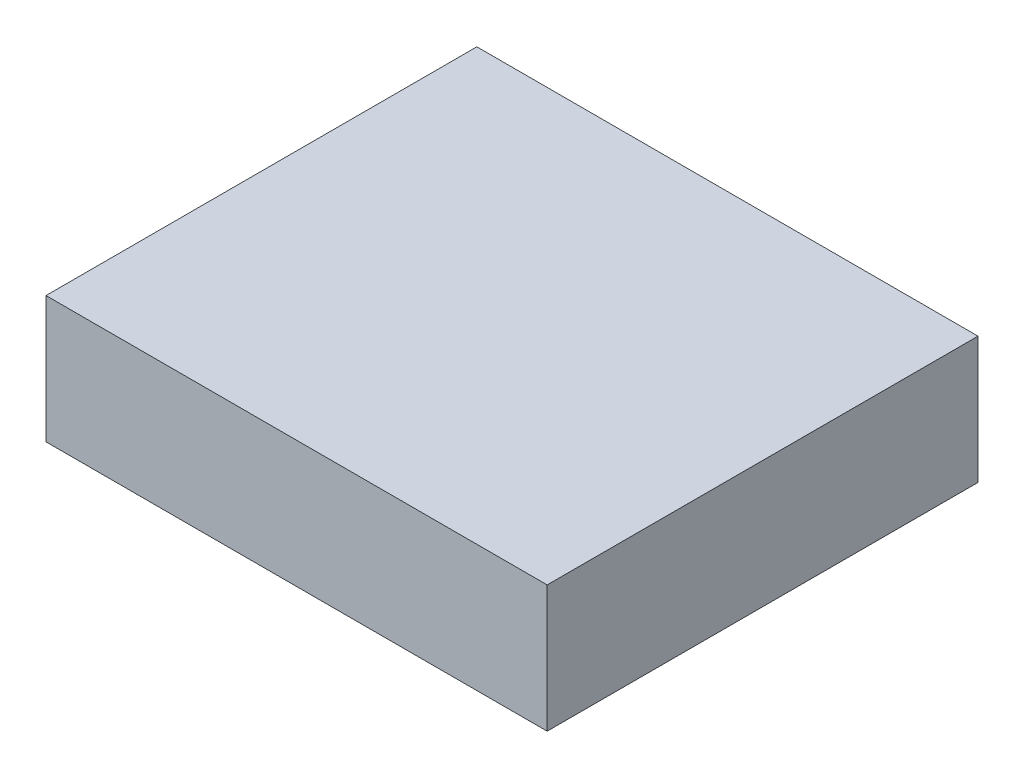
ISO-10303-21;
HEADER;
FILE_DESCRIPTION(('STEP AP214'),'2;1');
FILE_NAME('part.step','',(''),(''),'','','');
FILE_SCHEMA(('AUTOMOTIVE_DESIGN { 1 0 10303 214 1 1 1 1 }'));
ENDSEC;
DATA;
#1=APPLICATION_CONTEXT('core data for automotive mechanical design processes');
#2=APPLICATION_PROTOCOL_DEFINITION('international standard','automotive_design',2000,#1);
#3=PRODUCT_CONTEXT('',#1,'mechanical');
#4=PRODUCT('Part','Part','',(#3));
#5=PRODUCT_RELATED_PRODUCT_CATEGORY('part','',(#4));
#6=PRODUCT_DEFINITION_FORMATION('','',#4);
#7=PRODUCT_DEFINITION_CONTEXT('part definition',#1,'design');
#8=PRODUCT_DEFINITION('design','',#6,#7);
#9=PRODUCT_DEFINITION_SHAPE('','',#8);
#10=(LENGTH_UNIT() NAMED_UNIT(*) SI_UNIT(.MILLI.,.METRE.));
#11=(NAMED_UNIT(*) PLANE_ANGLE_UNIT() SI_UNIT($,.RADIAN.));
#12=(NAMED_UNIT(*) SI_UNIT($,.STERADIAN.) SOLID_ANGLE_UNIT());
#13=UNCERTAINTY_MEASURE_WITH_UNIT(LENGTH_MEASURE(1.E-05),#10,'distance_accuracy_value','');
#14=(GEOMETRIC_REPRESENTATION_CONTEXT(3) GLOBAL_UNCERTAINTY_ASSIGNED_CONTEXT((#13)) GLOBAL_UNIT_ASSIGNED_CONTEXT((#10,
#11,#12)) REPRESENTATION_CONTEXT('',''));
#15=CARTESIAN_POINT('',(0.,0.,0.));
#16=DIRECTION('',(0.,0.,1.));
#17=DIRECTION('',(1.,0.,0.));
#18=AXIS2_PLACEMENT_3D('',#15,#16,#17);
#19=CARTESIAN_POINT('',(0.,3.,0.));
#20=DIRECTION('',(0.,-1.,0.));
#21=DIRECTION('',(0.,0.,-1.));
#22=AXIS2_PLACEMENT_3D('',#19,#20,#21);
#23=PLANE('',#22);
#24=CARTESIAN_POINT('',(15.,3.,24.));
#25=DIRECTION('',(0.,1.,0.));
#26=DIRECTION('',(0.,0.,1.));
#27=AXIS2_PLACEMENT_3D('',#24,#25,#26);
#28=CIRCLE('',#27,10.5);
#29=CARTESIAN_POINT('',(15.,3.,34.5));
#30=VERTEX_POINT('',#29);
#31=EDGE_CURVE('E142',#30,#30,#28,.T.);
#32=ORIENTED_EDGE('',*,*,#31,.T.);
#33=EDGE_LOOP('',(#32));
#34=FACE_BOUND('',#33,.T.);
#35=DIRECTION('',(0.,0.,-1.));
#36=VECTOR('',#35,1.);
#37=CARTESIAN_POINT('',(-9.84277666215087,3.,40.));
#38=LINE('',#37,#36);
#39=CARTESIAN_POINT('',(-9.84277666215087,3.,39.8427766621509));
#40=VERTEX_POINT('',#39);
#41=CARTESIAN_POINT('',(-9.84277666215087,3.,48.8612539029861));
#42=VERTEX_POINT('',#41);
#43=EDGE_CURVE('E113',#40,#42,#38,.F.);
#44=ORIENTED_EDGE('',*,*,#43,.F.);
#45=DIRECTION('',(-1.,0.,0.));
#46=VECTOR('',#45,1.);
#47=CARTESIAN_POINT('',(-30.,3.,39.8427766621509));
#48=LINE('',#47,#46);
#49=CARTESIAN_POINT('',(-29.9475463643187,3.,39.8427766621509));
#50=VERTEX_POINT('',#49);
#51=EDGE_CURVE('E106',#50,#40,#48,.F.);
#52=ORIENTED_EDGE('',*,*,#51,.F.);
#53=CARTESIAN_POINT('',(0.,3.,0.));
#54=DIRECTION('',(0.,1.,0.));
#55=DIRECTION('',(0.,0.,1.));
#56=AXIS2_PLACEMENT_3D('',#53,#54,#55);
#57=CIRCLE('',#56,49.8427766621509);
#58=CARTESIAN_POINT('',(-42.8427766621509,3.,25.4715306424666));
#59=VERTEX_POINT('',#58);
#60=EDGE_CURVE('E110',#59,#50,#57,.T.);
#61=ORIENTED_EDGE('',*,*,#60,.F.);
#62=DIRECTION('',(0.,0.,-1.));
#63=VECTOR('',#62,1.);
#64=CARTESIAN_POINT('',(-42.8427766621509,3.,-25.5147016443462));
#65=LINE('',#64,#63);
#66=CARTESIAN_POINT('',(-42.8427766621509,3.,-25.4715306424666));
#67=VERTEX_POINT('',#66);
#68=EDGE_CURVE('E126',#67,#59,#65,.F.);
#69=ORIENTED_EDGE('',*,*,#68,.F.);
#70=CARTESIAN_POINT('',(0.,3.,0.));
#71=DIRECTION('',(0.,1.,0.));
#72=DIRECTION('',(0.,0.,1.));
#73=AXIS2_PLACEMENT_3D('',#70,#71,#72);
#74=CIRCLE('',#73,49.8427766621509);
#75=EDGE_CURVE('E211',#42,#67,#74,.T.);
#76=ORIENTED_EDGE('',*,*,#75,.F.);
#77=EDGE_LOOP('',(#44,#52,#61,#69,#76));
#78=FACE_BOUND('',#77,.T.);
#79=ADVANCED_FACE('F36',(#34,#78),#23,.T.);
#80=CARTESIAN_POINT('',(0.,3.,0.));
#81=DIRECTION('',(0.,1.,0.));
#82=DIRECTION('',(0.,0.,1.));
#83=AXIS2_PLACEMENT_3D('',#80,#81,#82);
#84=PLANE('',#83);
#85=CARTESIAN_POINT('',(15.,3.,24.));
#86=DIRECTION('',(0.,1.,0.));
#87=DIRECTION('',(0.,0.,1.));
#88=AXIS2_PLACEMENT_3D('',#85,#86,#87);
#89=CIRCLE('',#88,9.);
#90=CARTESIAN_POINT('',(15.,3.,33.));
#91=VERTEX_POINT('',#90);
#92=EDGE_CURVE('E145',#91,#91,#89,.T.);
#93=ORIENTED_EDGE('',*,*,#92,.F.);
#94=EDGE_LOOP('',(#93));
#95=FACE_BOUND('',#94,.T.);
#96=ADVANCED_FACE('F241',(#95),#84,.F.);
#97=CARTESIAN_POINT('',(15.,3.,24.));
#98=DIRECTION('',(0.,-1.,0.));
#99=DIRECTION('',(0.,0.,1.));
#100=AXIS2_PLACEMENT_3D('',#97,#98,#99);
#101=CONICAL_SURFACE('',#100,9.,0.05235987755983);
#102=CARTESIAN_POINT('',(15.,2.,24.));
#103=DIRECTION('',(0.,1.,0.));
#104=DIRECTION('',(0.,0.,1.));
#105=AXIS2_PLACEMENT_3D('',#102,#103,#104);
#106=CIRCLE('',#105,9.05240777928304);
#107=CARTESIAN_POINT('',(15.,2.,33.052407779283));
#108=VERTEX_POINT('',#107);
#109=EDGE_CURVE('E135',#108,#108,#106,.T.);
#110=ORIENTED_EDGE('',*,*,#109,.F.);
#111=EDGE_LOOP('',(#110));
#112=FACE_BOUND('',#111,.T.);
#113=ORIENTED_EDGE('',*,*,#92,.T.);
#114=EDGE_LOOP('',(#113));
#115=FACE_BOUND('',#114,.T.);
#116=ADVANCED_FACE('F247',(#112,#115),#101,.F.);
#117=CARTESIAN_POINT('',(15.,2.,24.));
#118=DIRECTION('',(0.,1.,0.));
#119=DIRECTION('',(0.,0.,1.));
#120=AXIS2_PLACEMENT_3D('',#117,#118,#119);
#121=PLANE('',#120);
#122=ORIENTED_EDGE('',*,*,#109,.T.);
#123=EDGE_LOOP('',(#122));
#124=FACE_BOUND('',#123,.T.);
#125=CARTESIAN_POINT('',(15.,2.,24.));
#126=DIRECTION('',(0.,1.,0.));
#127=DIRECTION('',(0.,0.,1.));
#128=AXIS2_PLACEMENT_3D('',#125,#126,#127);
#129=CIRCLE('',#128,10.447592220717);
#130=CARTESIAN_POINT('',(15.,2.,34.447592220717));
#131=VERTEX_POINT('',#130);
#132=EDGE_CURVE('E132',#131,#131,#129,.T.);
#133=ORIENTED_EDGE('',*,*,#132,.F.);
#134=EDGE_LOOP('',(#133));
#135=FACE_BOUND('',#134,.T.);
#136=ADVANCED_FACE('F256',(#124,#135),#121,.F.);
#137=CARTESIAN_POINT('',(15.,3.,24.));
#138=DIRECTION('',(0.,1.,0.));
#139=DIRECTION('',(0.,0.,1.));
#140=AXIS2_PLACEMENT_3D('',#137,#138,#139);
#141=CONICAL_SURFACE('',#140,10.5,0.05235987755983);
#142=ORIENTED_EDGE('',*,*,#132,.T.);
#143=EDGE_LOOP('',(#142));
#144=FACE_BOUND('',#143,.T.);
#145=ORIENTED_EDGE('',*,*,#31,.F.);
#146=EDGE_LOOP('',(#145));
#147=FACE_BOUND('',#146,.T.);
#148=ADVANCED_FACE('F259',(#144,#147),#141,.T.);
#149=CARTESIAN_POINT('',(0.,0.,0.));
#150=DIRECTION('',(0.,-1.,0.));
#151=DIRECTION('',(0.,0.,1.));
#152=AXIS2_PLACEMENT_3D('',#149,#150,#151);
#153=CONICAL_SURFACE('',#152,50.,0.05235987755983);
#154=CARTESIAN_POINT('',(0.,0.,0.));
#155=DIRECTION('',(0.,1.,0.));
#156=DIRECTION('',(0.,0.,1.));
#157=AXIS2_PLACEMENT_3D('',#154,#155,#156);
#158=CIRCLE('',#157,50.);
#159=CARTESIAN_POINT('',(-43.,0.,25.5147016443462));
#160=VERTEX_POINT('',#159);
#161=CARTESIAN_POINT('',(-30.,0.,40.));
#162=VERTEX_POINT('',#161);
#163=EDGE_CURVE('E178',#160,#162,#158,.T.);
#164=ORIENTED_EDGE('',*,*,#163,.F.);
#165=CARTESIAN_POINT('',(-42.8427766621509,3.,25.4715306424666));
#166=CARTESIAN_POINT('',(-42.8689805472113,2.50000008741177,25.4787319004716));
#167=CARTESIAN_POINT('',(-42.8951844345623,2.00000013111764,25.485930112964));
#168=CARTESIAN_POINT('',(-42.9475922138454,1.00000013111764,25.5003204469239));
#169=CARTESIAN_POINT('',(-42.9737961057774,0.500000087411772,25.5075125683913));
#170=CARTESIAN_POINT('',(-43.,0.,25.5147016443462));
#171=B_SPLINE_CURVE_WITH_KNOTS('',3,(#165,#166,#167,#168,#169,#170),.UNSPECIFIED.,.F.,.F.,(4,2,
4),(0.,1.50221360945296,3.00442721890574),.UNSPECIFIED.);
#172=EDGE_CURVE('E130',#59,#160,#171,.T.);
#173=ORIENTED_EDGE('',*,*,#172,.F.);
#174=ORIENTED_EDGE('',*,*,#60,.T.);
#175=CARTESIAN_POINT('',(-29.9475463643187,3.,39.8427766621509));
#176=CARTESIAN_POINT('',(-29.9562962840207,2.50000013333959,39.8689805448044));
#177=CARTESIAN_POINT('',(-29.9650423801785,2.00000020000936,39.8951844309519));
#178=CARTESIAN_POINT('',(-29.9825269254056,1.00000020000936,39.9475922102349));
#179=CARTESIAN_POINT('',(-29.9912653744749,0.500000133339591,39.9737961033704));
#180=CARTESIAN_POINT('',(-30.,0.,40.));
#181=B_SPLINE_CURVE_WITH_KNOTS('',3,(#175,#176,#177,#178,#179,#180),.UNSPECIFIED.,.F.,.F.,(4,2,
4),(0.,1.50228746936037,3.00457493872046),.UNSPECIFIED.);
#182=EDGE_CURVE('E121',#50,#162,#181,.T.);
#183=ORIENTED_EDGE('',*,*,#182,.T.);
#184=EDGE_LOOP('',(#164,#173,#174,#183));
#185=FACE_BOUND('',#184,.T.);
#186=ADVANCED_FACE('F128',(#185),#153,.F.);
#187=CARTESIAN_POINT('',(-43.,0.,-25.5147016443462));
#188=DIRECTION('',(-0.998629534754574,0.0523359562429439,0.));
#189=DIRECTION('',(-0.052335956242944,-0.998629534754574,0.));
#190=AXIS2_PLACEMENT_3D('',#187,#188,#189);
#191=PLANE('',#190);
#192=DIRECTION('',(0.,0.,1.));
#193=VECTOR('',#192,1.);
#194=CARTESIAN_POINT('',(-43.,0.,-25.5147016443462));
#195=LINE('',#194,#193);
#196=CARTESIAN_POINT('',(-43.,0.,-25.5147016443462));
#197=VERTEX_POINT('',#196);
#198=EDGE_CURVE('E181',#197,#160,#195,.T.);
#199=ORIENTED_EDGE('',*,*,#198,.F.);
#200=CARTESIAN_POINT('',(-42.8427766621509,3.,-25.4715306424666));
#201=CARTESIAN_POINT('',(-42.8689805472113,2.50000008741177,-25.4787319004716));
#202=CARTESIAN_POINT('',(-42.8951844345623,2.00000013111764,-25.485930112964));
#203=CARTESIAN_POINT('',(-42.9475922138454,1.00000013111764,-25.5003204469239));
#204=CARTESIAN_POINT('',(-42.9737961057774,0.500000087411773,-25.5075125683913));
#205=CARTESIAN_POINT('',(-43.,0.,-25.5147016443462));
#206=B_SPLINE_CURVE_WITH_KNOTS('',3,(#200,#201,#202,#203,#204,#205),.UNSPECIFIED.,.F.,.F.,(4,2,
4),(0.,1.50221360945296,3.00442721890574),.UNSPECIFIED.);
#207=EDGE_CURVE('E141',#67,#197,#206,.T.);
#208=ORIENTED_EDGE('',*,*,#207,.F.);
#209=ORIENTED_EDGE('',*,*,#68,.T.);
#210=ORIENTED_EDGE('',*,*,#172,.T.);
#211=EDGE_LOOP('',(#199,#208,#209,#210));
#212=FACE_BOUND('',#211,.T.);
#213=ADVANCED_FACE('F219',(#212),#191,.F.);
#214=CARTESIAN_POINT('',(0.,0.,0.));
#215=DIRECTION('',(0.,-1.,0.));
#216=DIRECTION('',(0.,0.,1.));
#217=AXIS2_PLACEMENT_3D('',#214,#215,#216);
#218=CONICAL_SURFACE('',#217,50.,0.05235987755983);
#219=CARTESIAN_POINT('',(0.,0.,0.));
#220=DIRECTION('',(0.,-1.,0.));
#221=DIRECTION('',(0.,0.,-1.));
#222=AXIS2_PLACEMENT_3D('',#219,#220,#221);
#223=CIRCLE('',#222,50.);
#224=CARTESIAN_POINT('',(-9.99999999999999,0.,48.9897948556636));
#225=VERTEX_POINT('',#224);
#226=EDGE_CURVE('E167',#225,#197,#223,.F.);
#227=ORIENTED_EDGE('',*,*,#226,.F.);
#228=CARTESIAN_POINT('',(-9.84277666215087,3.,48.8612539029861));
#229=CARTESIAN_POINT('',(-9.86898048888577,2.50000120032974,48.8827054863914));
#230=CARTESIAN_POINT('',(-9.895184347074,2.0000018004943,48.9041430241505));
#231=CARTESIAN_POINT('',(-9.94759212635704,1.0000018004943,48.9469900083763));
#232=CARTESIAN_POINT('',(-9.97379604745185,0.500001200329742,48.968399454843));
#233=CARTESIAN_POINT('',(-9.99999999999999,0.,48.9897948556636));
#234=B_SPLINE_CURVE_WITH_KNOTS('',3,(#228,#229,#230,#231,#232,#233),.UNSPECIFIED.,.F.,.F.,(4,2,
4),(0.,1.50343290186303,3.00686580372233),.UNSPECIFIED.);
#235=EDGE_CURVE('E117',#42,#225,#234,.T.);
#236=ORIENTED_EDGE('',*,*,#235,.F.);
#237=ORIENTED_EDGE('',*,*,#75,.T.);
#238=ORIENTED_EDGE('',*,*,#207,.T.);
#239=EDGE_LOOP('',(#227,#236,#237,#238));
#240=FACE_BOUND('',#239,.T.);
#241=ADVANCED_FACE('F222',(#240),#218,.F.);
#242=CARTESIAN_POINT('',(-9.99999999999999,0.,40.));
#243=DIRECTION('',(-0.998629534754574,0.0523359562429439,0.));
#244=DIRECTION('',(-0.052335956242944,-0.998629534754574,0.));
#245=AXIS2_PLACEMENT_3D('',#242,#243,#244);
#246=PLANE('',#245);
#247=DIRECTION('',(0.,0.,1.));
#248=VECTOR('',#247,1.);
#249=CARTESIAN_POINT('',(-9.99999999999999,0.,40.));
#250=LINE('',#249,#248);
#251=CARTESIAN_POINT('',(-10.,0.,40.));
#252=VERTEX_POINT('',#251);
#253=EDGE_CURVE('E177',#252,#225,#250,.T.);
#254=ORIENTED_EDGE('',*,*,#253,.F.);
#255=DIRECTION('',(-0.052264427688714,-0.997264688634237,0.0522644276887141));
#256=VECTOR('',#255,1.);
#257=CARTESIAN_POINT('',(-10.0546314080326,-1.04242936411264,40.0546314080326));
#258=LINE('',#257,#256);
#259=EDGE_CURVE('E116',#40,#252,#258,.T.);
#260=ORIENTED_EDGE('',*,*,#259,.F.);
#261=ORIENTED_EDGE('',*,*,#43,.T.);
#262=ORIENTED_EDGE('',*,*,#235,.T.);
#263=EDGE_LOOP('',(#254,#260,#261,#262));
#264=FACE_BOUND('',#263,.T.);
#265=ADVANCED_FACE('F227',(#264),#246,.F.);
#266=CARTESIAN_POINT('',(-30.,0.,40.));
#267=DIRECTION('',(0.,0.0523359562429439,0.998629534754574));
#268=DIRECTION('',(0.,-0.998629534754574,0.052335956242944));
#269=AXIS2_PLACEMENT_3D('',#266,#267,#268);
#270=PLANE('',#269);
#271=DIRECTION('',(1.,0.,0.));
#272=VECTOR('',#271,1.);
#273=CARTESIAN_POINT('',(-30.,0.,40.));
#274=LINE('',#273,#272);
#275=EDGE_CURVE('E123',#162,#252,#274,.T.);
#276=ORIENTED_EDGE('',*,*,#275,.F.);
#277=ORIENTED_EDGE('',*,*,#182,.F.);
#278=ORIENTED_EDGE('',*,*,#51,.T.);
#279=ORIENTED_EDGE('',*,*,#259,.T.);
#280=EDGE_LOOP('',(#276,#277,#278,#279));
#281=FACE_BOUND('',#280,.T.);
#282=ADVANCED_FACE('F122',(#281),#270,.F.);
#283=CARTESIAN_POINT('',(-43.,0.,-25.5147016443462));
#284=DIRECTION('',(0.,-1.,0.));
#285=DIRECTION('',(0.,0.,1.));
#286=AXIS2_PLACEMENT_3D('',#283,#284,#285);
#287=PLANE('',#286);
#288=DIRECTION('',(0.,0.,-1.));
#289=VECTOR('',#288,1.);
#290=CARTESIAN_POINT('',(79.1055408484251,0.,-68.0066108869367));
#291=LINE('',#290,#289);
#292=CARTESIAN_POINT('',(79.1055408484251,0.,68.0066108869367));
#293=VERTEX_POINT('',#292);
#294=CARTESIAN_POINT('',(79.1055408484251,0.,-68.0066108869367));
#295=VERTEX_POINT('',#294);
#296=EDGE_CURVE('E47',#293,#295,#291,.T.);
#297=ORIENTED_EDGE('',*,*,#296,.F.);
#298=DIRECTION('',(1.,0.,0.));
#299=VECTOR('',#298,1.);
#300=CARTESIAN_POINT('',(-79.1055408484251,0.,68.0066108869367));
#301=LINE('',#300,#299);
#302=CARTESIAN_POINT('',(-79.1055408484251,0.,68.0066108869367));
#303=VERTEX_POINT('',#302);
#304=EDGE_CURVE('E146',#303,#293,#301,.T.);
#305=ORIENTED_EDGE('',*,*,#304,.F.);
#306=DIRECTION('',(0.,0.,1.));
#307=VECTOR('',#306,1.);
#308=CARTESIAN_POINT('',(-79.1055408484251,0.,-68.0066108869367));
#309=LINE('',#308,#307);
#310=CARTESIAN_POINT('',(-79.1055408484251,0.,-68.0066108869367));
#311=VERTEX_POINT('',#310);
#312=EDGE_CURVE('E157',#311,#303,#309,.T.);
#313=ORIENTED_EDGE('',*,*,#312,.F.);
#314=DIRECTION('',(-1.,0.,0.));
#315=VECTOR('',#314,1.);
#316=CARTESIAN_POINT('',(-79.1055408484251,0.,-68.0066108869367));
#317=LINE('',#316,#315);
#318=EDGE_CURVE('E153',#295,#311,#317,.T.);
#319=ORIENTED_EDGE('',*,*,#318,.F.);
#320=EDGE_LOOP('',(#297,#305,#313,#319));
#321=FACE_BOUND('',#320,.T.);
#322=ORIENTED_EDGE('',*,*,#198,.T.);
#323=ORIENTED_EDGE('',*,*,#163,.T.);
#324=ORIENTED_EDGE('',*,*,#275,.T.);
#325=ORIENTED_EDGE('',*,*,#253,.T.);
#326=ORIENTED_EDGE('',*,*,#226,.T.);
#327=EDGE_LOOP('',(#322,#323,#324,#325,#326));
#328=FACE_BOUND('',#327,.T.);
#329=ADVANCED_FACE('F38',(#321,#328),#287,.T.);
#330=CARTESIAN_POINT('',(0.,40.,0.));
#331=DIRECTION('',(0.,1.,0.));
#332=DIRECTION('',(0.,0.,1.));
#333=AXIS2_PLACEMENT_3D('',#330,#331,#332);
#334=PLANE('',#333);
#335=DIRECTION('',(0.,0.,1.));
#336=VECTOR('',#335,1.);
#337=CARTESIAN_POINT('',(79.1055408484251,40.,-68.0066108869367));
#338=LINE('',#337,#336);
#339=CARTESIAN_POINT('',(79.1055408484251,40.,-68.0066108869367));
#340=VERTEX_POINT('',#339);
#341=CARTESIAN_POINT('',(79.1055408484251,40.,68.0066108869367));
#342=VERTEX_POINT('',#341);
#343=EDGE_CURVE('E11',#340,#342,#338,.T.);
#344=ORIENTED_EDGE('',*,*,#343,.F.);
#345=DIRECTION('',(1.,0.,0.));
#346=VECTOR('',#345,1.);
#347=CARTESIAN_POINT('',(-79.1055408484251,40.,-68.0066108869367));
#348=LINE('',#347,#346);
#349=CARTESIAN_POINT('',(-79.1055408484251,40.,-68.0066108869367));
#350=VERTEX_POINT('',#349);
#351=EDGE_CURVE('E156',#350,#340,#348,.T.);
#352=ORIENTED_EDGE('',*,*,#351,.F.);
#353=DIRECTION('',(0.,0.,-1.));
#354=VECTOR('',#353,1.);
#355=CARTESIAN_POINT('',(-79.1055408484251,40.,-68.0066108869367));
#356=LINE('',#355,#354);
#357=CARTESIAN_POINT('',(-79.1055408484251,40.,68.0066108869367));
#358=VERTEX_POINT('',#357);
#359=EDGE_CURVE('E160',#358,#350,#356,.T.);
#360=ORIENTED_EDGE('',*,*,#359,.F.);
#361=DIRECTION('',(-1.,0.,0.));
#362=VECTOR('',#361,1.);
#363=CARTESIAN_POINT('',(-79.1055408484251,40.,68.0066108869367));
#364=LINE('',#363,#362);
#365=EDGE_CURVE('E149',#342,#358,#364,.T.);
#366=ORIENTED_EDGE('',*,*,#365,.F.);
#367=EDGE_LOOP('',(#344,#352,#360,#366));
#368=FACE_BOUND('',#367,.T.);
#369=ADVANCED_FACE('F238',(#368),#334,.T.);
#370=CARTESIAN_POINT('',(-79.1055408484251,40.,68.0066108869367));
#371=DIRECTION('',(0.,0.,1.));
#372=DIRECTION('',(1.,0.,0.));
#373=AXIS2_PLACEMENT_3D('',#370,#371,#372);
#374=PLANE('',#373);
#375=DIRECTION('',(0.,-1.,0.));
#376=VECTOR('',#375,1.);
#377=CARTESIAN_POINT('',(-79.1055408484251,40.,68.0066108869367));
#378=LINE('',#377,#376);
#379=EDGE_CURVE('E150',#358,#303,#378,.T.);
#380=ORIENTED_EDGE('',*,*,#379,.T.);
#381=ORIENTED_EDGE('',*,*,#304,.T.);
#382=DIRECTION('',(0.,-1.,0.));
#383=VECTOR('',#382,1.);
#384=CARTESIAN_POINT('',(79.1055408484251,40.,68.0066108869367));
#385=LINE('',#384,#383);
#386=EDGE_CURVE('E152',#342,#293,#385,.T.);
#387=ORIENTED_EDGE('',*,*,#386,.F.);
#388=ORIENTED_EDGE('',*,*,#365,.T.);
#389=EDGE_LOOP('',(#380,#381,#387,#388));
#390=FACE_BOUND('',#389,.T.);
#391=ADVANCED_FACE('F251',(#390),#374,.T.);
#392=CARTESIAN_POINT('',(-79.1055408484251,40.,-68.0066108869367));
#393=DIRECTION('',(-1.,0.,0.));
#394=DIRECTION('',(0.,0.,1.));
#395=AXIS2_PLACEMENT_3D('',#392,#393,#394);
#396=PLANE('',#395);
#397=DIRECTION('',(0.,-1.,0.));
#398=VECTOR('',#397,1.);
#399=CARTESIAN_POINT('',(-79.1055408484251,40.,-68.0066108869367));
#400=LINE('',#399,#398);
#401=EDGE_CURVE('E161',#350,#311,#400,.T.);
#402=ORIENTED_EDGE('',*,*,#401,.T.);
#403=ORIENTED_EDGE('',*,*,#312,.T.);
#404=ORIENTED_EDGE('',*,*,#379,.F.);
#405=ORIENTED_EDGE('',*,*,#359,.T.);
#406=EDGE_LOOP('',(#402,#403,#404,#405));
#407=FACE_BOUND('',#406,.T.);
#408=ADVANCED_FACE('F342',(#407),#396,.T.);
#409=CARTESIAN_POINT('',(-79.1055408484251,40.,-68.0066108869367));
#410=DIRECTION('',(0.,0.,-1.));
#411=DIRECTION('',(-1.,0.,0.));
#412=AXIS2_PLACEMENT_3D('',#409,#410,#411);
#413=PLANE('',#412);
#414=DIRECTION('',(0.,-1.,0.));
#415=VECTOR('',#414,1.);
#416=CARTESIAN_POINT('',(79.1055408484251,40.,-68.0066108869367));
#417=LINE('',#416,#415);
#418=EDGE_CURVE('E55',#340,#295,#417,.T.);
#419=ORIENTED_EDGE('',*,*,#418,.T.);
#420=ORIENTED_EDGE('',*,*,#318,.T.);
#421=ORIENTED_EDGE('',*,*,#401,.F.);
#422=ORIENTED_EDGE('',*,*,#351,.T.);
#423=EDGE_LOOP('',(#419,#420,#421,#422));
#424=FACE_BOUND('',#423,.T.);
#425=ADVANCED_FACE('F351',(#424),#413,.T.);
#426=CARTESIAN_POINT('',(79.1055408484251,40.,-68.0066108869367));
#427=DIRECTION('',(1.,0.,0.));
#428=DIRECTION('',(0.,0.,-1.));
#429=AXIS2_PLACEMENT_3D('',#426,#427,#428);
#430=PLANE('',#429);
#431=ORIENTED_EDGE('',*,*,#386,.T.);
#432=ORIENTED_EDGE('',*,*,#296,.T.);
#433=ORIENTED_EDGE('',*,*,#418,.F.);
#434=ORIENTED_EDGE('',*,*,#343,.T.);
#435=EDGE_LOOP('',(#431,#432,#433,#434));
#436=FACE_BOUND('',#435,.T.);
#437=ADVANCED_FACE('F360',(#436),#430,.T.);
#438=CLOSED_SHELL('',(#79,#96,#116,#136,#148,#186,#213,#241,#265,#282,#329,#369,#391,#408,#425,#437));
#439=MANIFOLD_SOLID_BREP('B2',#438);
#440=ADVANCED_BREP_SHAPE_REPRESENTATION('',(#18,#439),#14);
#441=SHAPE_DEFINITION_REPRESENTATION(#9,#440);
ENDSEC;
END-ISO-10303-21;
